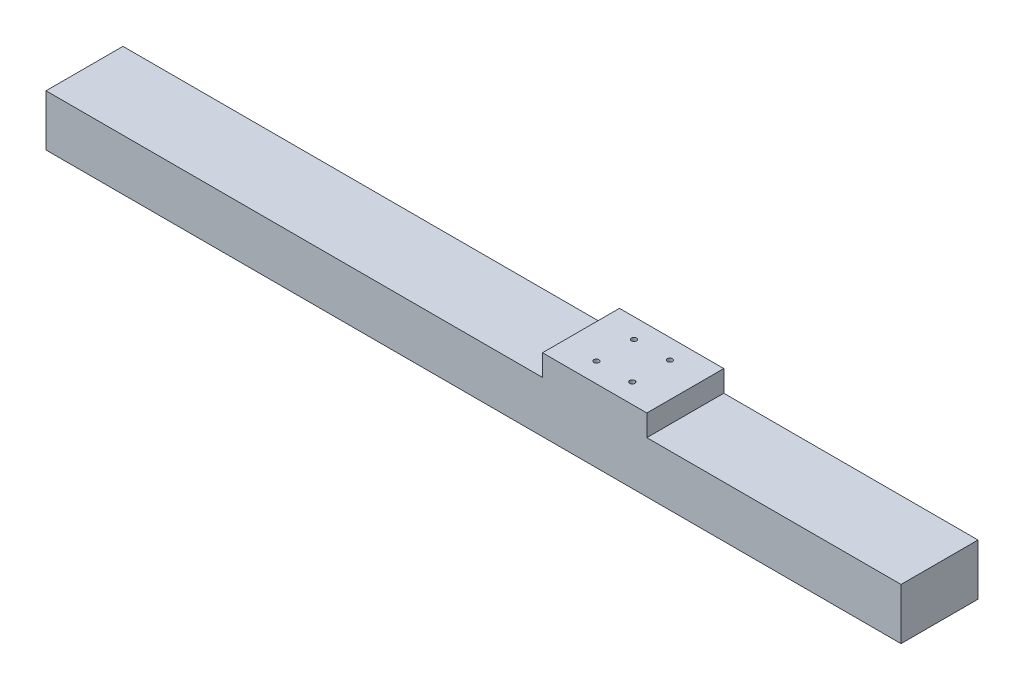
ISO-10303-21;
HEADER;
FILE_DESCRIPTION(('STEP AP214'),'2;1');
FILE_NAME('part.step','',(''),(''),'','','');
FILE_SCHEMA(('AUTOMOTIVE_DESIGN { 1 0 10303 214 1 1 1 1 }'));
ENDSEC;
DATA;
#1=APPLICATION_CONTEXT('core data for automotive mechanical design processes');
#2=APPLICATION_PROTOCOL_DEFINITION('international standard','automotive_design',2000,#1);
#3=PRODUCT_CONTEXT('',#1,'mechanical');
#4=PRODUCT('Part','Part','',(#3));
#5=PRODUCT_RELATED_PRODUCT_CATEGORY('part','',(#4));
#6=PRODUCT_DEFINITION_FORMATION('','',#4);
#7=PRODUCT_DEFINITION_CONTEXT('part definition',#1,'design');
#8=PRODUCT_DEFINITION('design','',#6,#7);
#9=PRODUCT_DEFINITION_SHAPE('','',#8);
#10=(LENGTH_UNIT() NAMED_UNIT(*) SI_UNIT(.MILLI.,.METRE.));
#11=(NAMED_UNIT(*) PLANE_ANGLE_UNIT() SI_UNIT($,.RADIAN.));
#12=(NAMED_UNIT(*) SI_UNIT($,.STERADIAN.) SOLID_ANGLE_UNIT());
#13=UNCERTAINTY_MEASURE_WITH_UNIT(LENGTH_MEASURE(1.E-05),#10,'distance_accuracy_value','');
#14=(GEOMETRIC_REPRESENTATION_CONTEXT(3) GLOBAL_UNCERTAINTY_ASSIGNED_CONTEXT((#13)) GLOBAL_UNIT_ASSIGNED_CONTEXT((#10,
#11,#12)) REPRESENTATION_CONTEXT('',''));
#15=CARTESIAN_POINT('',(0.,0.,0.));
#16=DIRECTION('',(0.,0.,1.));
#17=DIRECTION('',(1.,0.,0.));
#18=AXIS2_PLACEMENT_3D('',#15,#16,#17);
#19=CARTESIAN_POINT('',(0.,60.,0.));
#20=DIRECTION('',(0.,1.,0.));
#21=DIRECTION('',(0.,0.,1.));
#22=AXIS2_PLACEMENT_3D('',#19,#20,#21);
#23=PLANE('',#22);
#24=DIRECTION('',(0.,0.,1.));
#25=VECTOR('',#24,1.);
#26=CARTESIAN_POINT('',(455.382198594935,60.,0.));
#27=LINE('',#26,#25);
#28=CARTESIAN_POINT('',(455.382198594935,60.,0.));
#29=VERTEX_POINT('',#28);
#30=CARTESIAN_POINT('',(455.382198594935,60.,90.));
#31=VERTEX_POINT('',#30);
#32=EDGE_CURVE('E52',#29,#31,#27,.T.);
#33=ORIENTED_EDGE('',*,*,#32,.F.);
#34=DIRECTION('',(-1.,0.,0.));
#35=VECTOR('',#34,1.);
#36=CARTESIAN_POINT('',(-125.305466237942,60.,0.));
#37=LINE('',#36,#35);
#38=CARTESIAN_POINT('',(-125.305466237942,60.,0.));
#39=VERTEX_POINT('',#38);
#40=EDGE_CURVE('E141',#29,#39,#37,.T.);
#41=ORIENTED_EDGE('',*,*,#40,.T.);
#42=DIRECTION('',(0.,0.,1.));
#43=VECTOR('',#42,1.);
#44=CARTESIAN_POINT('',(-125.305466237942,60.,0.));
#45=LINE('',#44,#43);
#46=CARTESIAN_POINT('',(-125.305466237942,60.,90.));
#47=VERTEX_POINT('',#46);
#48=EDGE_CURVE('E132',#39,#47,#45,.T.);
#49=ORIENTED_EDGE('',*,*,#48,.T.);
#50=DIRECTION('',(1.,0.,0.));
#51=VECTOR('',#50,1.);
#52=CARTESIAN_POINT('',(-125.305466237942,60.,90.));
#53=LINE('',#52,#51);
#54=EDGE_CURVE('E137',#47,#31,#53,.T.);
#55=ORIENTED_EDGE('',*,*,#54,.T.);
#56=EDGE_LOOP('',(#33,#41,#49,#55));
#57=FACE_BOUND('',#56,.T.);
#58=ADVANCED_FACE('F37',(#57),#23,.T.);
#59=CARTESIAN_POINT('',(-125.305466237942,60.,0.));
#60=DIRECTION('',(1.,0.,0.));
#61=DIRECTION('',(0.,0.,-1.));
#62=AXIS2_PLACEMENT_3D('',#59,#60,#61);
#63=PLANE('',#62);
#64=DIRECTION('',(0.,0.,1.));
#65=VECTOR('',#64,1.);
#66=CARTESIAN_POINT('',(-125.305466237942,0.,0.));
#67=LINE('',#66,#65);
#68=CARTESIAN_POINT('',(-125.305466237942,0.,0.));
#69=VERTEX_POINT('',#68);
#70=CARTESIAN_POINT('',(-125.305466237942,0.,90.));
#71=VERTEX_POINT('',#70);
#72=EDGE_CURVE('E123',#69,#71,#67,.T.);
#73=ORIENTED_EDGE('',*,*,#72,.T.);
#74=DIRECTION('',(0.,-1.,0.));
#75=VECTOR('',#74,1.);
#76=CARTESIAN_POINT('',(-125.305466237942,60.,90.));
#77=LINE('',#76,#75);
#78=EDGE_CURVE('E11',#47,#71,#77,.T.);
#79=ORIENTED_EDGE('',*,*,#78,.F.);
#80=ORIENTED_EDGE('',*,*,#48,.F.);
#81=DIRECTION('',(0.,-1.,0.));
#82=VECTOR('',#81,1.);
#83=CARTESIAN_POINT('',(-125.305466237942,60.,0.));
#84=LINE('',#83,#82);
#85=EDGE_CURVE('E143',#39,#69,#84,.T.);
#86=ORIENTED_EDGE('',*,*,#85,.T.);
#87=EDGE_LOOP('',(#73,#79,#80,#86));
#88=FACE_BOUND('',#87,.T.);
#89=ADVANCED_FACE('F39',(#88),#63,.F.);
#90=CARTESIAN_POINT('',(-125.305466237942,60.,90.));
#91=DIRECTION('',(0.,0.,-1.));
#92=DIRECTION('',(-1.,0.,0.));
#93=AXIS2_PLACEMENT_3D('',#90,#91,#92);
#94=PLANE('',#93);
#95=DIRECTION('',(1.,0.,0.));
#96=VECTOR('',#95,1.);
#97=CARTESIAN_POINT('',(-125.305466237942,0.,90.));
#98=LINE('',#97,#96);
#99=CARTESIAN_POINT('',(874.694533762058,0.,90.));
#100=VERTEX_POINT('',#99);
#101=EDGE_CURVE('E126',#71,#100,#98,.T.);
#102=ORIENTED_EDGE('',*,*,#101,.T.);
#103=DIRECTION('',(0.,-1.,0.));
#104=VECTOR('',#103,1.);
#105=CARTESIAN_POINT('',(874.694533762058,60.,90.));
#106=LINE('',#105,#104);
#107=CARTESIAN_POINT('',(874.694533762058,60.,90.));
#108=VERTEX_POINT('',#107);
#109=EDGE_CURVE('E45',#108,#100,#106,.T.);
#110=ORIENTED_EDGE('',*,*,#109,.F.);
#111=CARTESIAN_POINT('',(577.382198594935,60.,90.));
#112=VERTEX_POINT('',#111);
#113=EDGE_CURVE('E135',#112,#108,#53,.T.);
#114=ORIENTED_EDGE('',*,*,#113,.F.);
#115=DIRECTION('',(0.,-1.,0.));
#116=VECTOR('',#115,1.);
#117=CARTESIAN_POINT('',(577.382198594935,85.,90.));
#118=LINE('',#117,#116);
#119=CARTESIAN_POINT('',(577.382198594935,85.,90.));
#120=VERTEX_POINT('',#119);
#121=EDGE_CURVE('E108',#120,#112,#118,.T.);
#122=ORIENTED_EDGE('',*,*,#121,.F.);
#123=DIRECTION('',(1.,0.,0.));
#124=VECTOR('',#123,1.);
#125=CARTESIAN_POINT('',(455.382198594935,85.,90.));
#126=LINE('',#125,#124);
#127=CARTESIAN_POINT('',(455.382198594935,85.,90.));
#128=VERTEX_POINT('',#127);
#129=EDGE_CURVE('E102',#128,#120,#126,.T.);
#130=ORIENTED_EDGE('',*,*,#129,.F.);
#131=DIRECTION('',(0.,-1.,0.));
#132=VECTOR('',#131,1.);
#133=CARTESIAN_POINT('',(455.382198594935,85.,90.));
#134=LINE('',#133,#132);
#135=EDGE_CURVE('E106',#128,#31,#134,.T.);
#136=ORIENTED_EDGE('',*,*,#135,.T.);
#137=ORIENTED_EDGE('',*,*,#54,.F.);
#138=ORIENTED_EDGE('',*,*,#78,.T.);
#139=EDGE_LOOP('',(#102,#110,#114,#122,#130,#136,#137,#138));
#140=FACE_BOUND('',#139,.T.);
#141=ADVANCED_FACE('F104',(#140),#94,.F.);
#142=CARTESIAN_POINT('',(874.694533762058,60.,0.));
#143=DIRECTION('',(-1.,0.,0.));
#144=DIRECTION('',(0.,0.,1.));
#145=AXIS2_PLACEMENT_3D('',#142,#143,#144);
#146=PLANE('',#145);
#147=DIRECTION('',(0.,0.,-1.));
#148=VECTOR('',#147,1.);
#149=CARTESIAN_POINT('',(874.694533762058,0.,0.));
#150=LINE('',#149,#148);
#151=CARTESIAN_POINT('',(874.694533762058,0.,0.));
#152=VERTEX_POINT('',#151);
#153=EDGE_CURVE('E146',#100,#152,#150,.T.);
#154=ORIENTED_EDGE('',*,*,#153,.T.);
#155=DIRECTION('',(0.,-1.,0.));
#156=VECTOR('',#155,1.);
#157=CARTESIAN_POINT('',(874.694533762058,60.,0.));
#158=LINE('',#157,#156);
#159=CARTESIAN_POINT('',(874.694533762058,60.,0.));
#160=VERTEX_POINT('',#159);
#161=EDGE_CURVE('E151',#160,#152,#158,.T.);
#162=ORIENTED_EDGE('',*,*,#161,.F.);
#163=DIRECTION('',(0.,0.,-1.));
#164=VECTOR('',#163,1.);
#165=CARTESIAN_POINT('',(874.694533762058,60.,0.));
#166=LINE('',#165,#164);
#167=EDGE_CURVE('E139',#108,#160,#166,.T.);
#168=ORIENTED_EDGE('',*,*,#167,.F.);
#169=ORIENTED_EDGE('',*,*,#109,.T.);
#170=EDGE_LOOP('',(#154,#162,#168,#169));
#171=FACE_BOUND('',#170,.T.);
#172=ADVANCED_FACE('F158',(#171),#146,.F.);
#173=CARTESIAN_POINT('',(-125.305466237942,60.,0.));
#174=DIRECTION('',(0.,0.,1.));
#175=DIRECTION('',(1.,0.,0.));
#176=AXIS2_PLACEMENT_3D('',#173,#174,#175);
#177=PLANE('',#176);
#178=DIRECTION('',(-1.,0.,0.));
#179=VECTOR('',#178,1.);
#180=CARTESIAN_POINT('',(-125.305466237942,0.,0.));
#181=LINE('',#180,#179);
#182=EDGE_CURVE('E136',#152,#69,#181,.T.);
#183=ORIENTED_EDGE('',*,*,#182,.T.);
#184=ORIENTED_EDGE('',*,*,#85,.F.);
#185=ORIENTED_EDGE('',*,*,#40,.F.);
#186=DIRECTION('',(0.,-1.,0.));
#187=VECTOR('',#186,1.);
#188=CARTESIAN_POINT('',(455.382198594935,85.,0.));
#189=LINE('',#188,#187);
#190=CARTESIAN_POINT('',(455.382198594935,85.,0.));
#191=VERTEX_POINT('',#190);
#192=EDGE_CURVE('E171',#191,#29,#189,.T.);
#193=ORIENTED_EDGE('',*,*,#192,.F.);
#194=DIRECTION('',(-1.,0.,0.));
#195=VECTOR('',#194,1.);
#196=CARTESIAN_POINT('',(455.382198594935,85.,0.));
#197=LINE('',#196,#195);
#198=CARTESIAN_POINT('',(577.382198594935,85.,0.));
#199=VERTEX_POINT('',#198);
#200=EDGE_CURVE('E117',#199,#191,#197,.T.);
#201=ORIENTED_EDGE('',*,*,#200,.F.);
#202=DIRECTION('',(0.,-1.,0.));
#203=VECTOR('',#202,1.);
#204=CARTESIAN_POINT('',(577.382198594935,85.,0.));
#205=LINE('',#204,#203);
#206=CARTESIAN_POINT('',(577.382198594935,60.,0.));
#207=VERTEX_POINT('',#206);
#208=EDGE_CURVE('E128',#199,#207,#205,.T.);
#209=ORIENTED_EDGE('',*,*,#208,.T.);
#210=EDGE_CURVE('E142',#160,#207,#37,.T.);
#211=ORIENTED_EDGE('',*,*,#210,.F.);
#212=ORIENTED_EDGE('',*,*,#161,.T.);
#213=EDGE_LOOP('',(#183,#184,#185,#193,#201,#209,#211,#212));
#214=FACE_BOUND('',#213,.T.);
#215=ADVANCED_FACE('F166',(#214),#177,.F.);
#216=DIRECTION('',(0.,0.,-1.));
#217=VECTOR('',#216,1.);
#218=CARTESIAN_POINT('',(577.382198594935,60.,0.));
#219=LINE('',#218,#217);
#220=EDGE_CURVE('E60',#112,#207,#219,.T.);
#221=ORIENTED_EDGE('',*,*,#220,.F.);
#222=ORIENTED_EDGE('',*,*,#113,.T.);
#223=ORIENTED_EDGE('',*,*,#167,.T.);
#224=ORIENTED_EDGE('',*,*,#210,.T.);
#225=EDGE_LOOP('',(#221,#222,#223,#224));
#226=FACE_BOUND('',#225,.T.);
#227=ADVANCED_FACE('F226',(#226),#23,.T.);
#228=CARTESIAN_POINT('',(0.,0.,0.));
#229=DIRECTION('',(0.,1.,0.));
#230=DIRECTION('',(0.,0.,1.));
#231=AXIS2_PLACEMENT_3D('',#228,#229,#230);
#232=PLANE('',#231);
#233=ORIENTED_EDGE('',*,*,#72,.F.);
#234=ORIENTED_EDGE('',*,*,#182,.F.);
#235=ORIENTED_EDGE('',*,*,#153,.F.);
#236=ORIENTED_EDGE('',*,*,#101,.F.);
#237=EDGE_LOOP('',(#233,#234,#235,#236));
#238=FACE_BOUND('',#237,.T.);
#239=ADVANCED_FACE('F163',(#238),#232,.F.);
#240=CARTESIAN_POINT('',(455.382198594935,85.,0.));
#241=DIRECTION('',(1.,0.,0.));
#242=DIRECTION('',(0.,0.,-1.));
#243=AXIS2_PLACEMENT_3D('',#240,#241,#242);
#244=PLANE('',#243);
#245=ORIENTED_EDGE('',*,*,#32,.T.);
#246=ORIENTED_EDGE('',*,*,#135,.F.);
#247=DIRECTION('',(0.,0.,1.));
#248=VECTOR('',#247,1.);
#249=CARTESIAN_POINT('',(455.382198594935,85.,0.));
#250=LINE('',#249,#248);
#251=EDGE_CURVE('E112',#191,#128,#250,.T.);
#252=ORIENTED_EDGE('',*,*,#251,.F.);
#253=ORIENTED_EDGE('',*,*,#192,.T.);
#254=EDGE_LOOP('',(#245,#246,#252,#253));
#255=FACE_BOUND('',#254,.T.);
#256=ADVANCED_FACE('F122',(#255),#244,.F.);
#257=CARTESIAN_POINT('',(577.382198594935,85.,0.));
#258=DIRECTION('',(-1.,0.,0.));
#259=DIRECTION('',(0.,0.,1.));
#260=AXIS2_PLACEMENT_3D('',#257,#258,#259);
#261=PLANE('',#260);
#262=ORIENTED_EDGE('',*,*,#220,.T.);
#263=ORIENTED_EDGE('',*,*,#208,.F.);
#264=DIRECTION('',(0.,0.,-1.));
#265=VECTOR('',#264,1.);
#266=CARTESIAN_POINT('',(577.382198594935,85.,0.));
#267=LINE('',#266,#265);
#268=EDGE_CURVE('E111',#120,#199,#267,.T.);
#269=ORIENTED_EDGE('',*,*,#268,.F.);
#270=ORIENTED_EDGE('',*,*,#121,.T.);
#271=EDGE_LOOP('',(#262,#263,#269,#270));
#272=FACE_BOUND('',#271,.T.);
#273=ADVANCED_FACE('F209',(#272),#261,.F.);
#274=CARTESIAN_POINT('',(0.,85.,0.));
#275=DIRECTION('',(0.,1.,0.));
#276=DIRECTION('',(0.,0.,1.));
#277=AXIS2_PLACEMENT_3D('',#274,#275,#276);
#278=PLANE('',#277);
#279=CARTESIAN_POINT('',(495.382198594935,85.,67.));
#280=DIRECTION('',(0.,1.,0.));
#281=DIRECTION('',(0.,0.,1.));
#282=AXIS2_PLACEMENT_3D('',#279,#280,#281);
#283=CIRCLE('',#282,2.99999999999999);
#284=CARTESIAN_POINT('',(495.382198594935,85.,70.));
#285=VERTEX_POINT('',#284);
#286=EDGE_CURVE('E189',#285,#285,#283,.T.);
#287=ORIENTED_EDGE('',*,*,#286,.F.);
#288=EDGE_LOOP('',(#287));
#289=FACE_BOUND('',#288,.T.);
#290=CARTESIAN_POINT('',(537.382198594936,85.,67.));
#291=DIRECTION('',(0.,1.,0.));
#292=DIRECTION('',(0.,0.,1.));
#293=AXIS2_PLACEMENT_3D('',#290,#291,#292);
#294=CIRCLE('',#293,3.00000000000005);
#295=CARTESIAN_POINT('',(537.382198594936,85.,70.));
#296=VERTEX_POINT('',#295);
#297=EDGE_CURVE('E195',#296,#296,#294,.T.);
#298=ORIENTED_EDGE('',*,*,#297,.F.);
#299=EDGE_LOOP('',(#298));
#300=FACE_BOUND('',#299,.T.);
#301=CARTESIAN_POINT('',(537.382198594936,85.,23.));
#302=DIRECTION('',(0.,1.,0.));
#303=DIRECTION('',(0.,0.,1.));
#304=AXIS2_PLACEMENT_3D('',#301,#302,#303);
#305=CIRCLE('',#304,3.00000000000005);
#306=CARTESIAN_POINT('',(537.382198594936,85.,26.));
#307=VERTEX_POINT('',#306);
#308=EDGE_CURVE('E183',#307,#307,#305,.T.);
#309=ORIENTED_EDGE('',*,*,#308,.F.);
#310=EDGE_LOOP('',(#309));
#311=FACE_BOUND('',#310,.T.);
#312=CARTESIAN_POINT('',(495.382198594935,85.,23.));
#313=DIRECTION('',(0.,1.,0.));
#314=DIRECTION('',(0.,0.,1.));
#315=AXIS2_PLACEMENT_3D('',#312,#313,#314);
#316=CIRCLE('',#315,2.99999999999999);
#317=CARTESIAN_POINT('',(495.382198594935,85.,26.));
#318=VERTEX_POINT('',#317);
#319=EDGE_CURVE('E180',#318,#318,#316,.T.);
#320=ORIENTED_EDGE('',*,*,#319,.F.);
#321=EDGE_LOOP('',(#320));
#322=FACE_BOUND('',#321,.T.);
#323=ORIENTED_EDGE('',*,*,#251,.T.);
#324=ORIENTED_EDGE('',*,*,#129,.T.);
#325=ORIENTED_EDGE('',*,*,#268,.T.);
#326=ORIENTED_EDGE('',*,*,#200,.T.);
#327=EDGE_LOOP('',(#323,#324,#325,#326));
#328=FACE_BOUND('',#327,.T.);
#329=ADVANCED_FACE('F115',(#289,#300,#311,#322,#328),#278,.T.);
#330=CARTESIAN_POINT('',(495.382198594935,75.,23.));
#331=DIRECTION('',(0.,1.,0.));
#332=DIRECTION('',(0.,0.,1.));
#333=AXIS2_PLACEMENT_3D('',#330,#331,#332);
#334=CYLINDRICAL_SURFACE('',#333,2.99999999999999);
#335=CARTESIAN_POINT('',(495.382198594935,75.,23.));
#336=DIRECTION('',(0.,1.,0.));
#337=DIRECTION('',(0.,0.,1.));
#338=AXIS2_PLACEMENT_3D('',#335,#336,#337);
#339=CIRCLE('',#338,2.99999999999999);
#340=CARTESIAN_POINT('',(495.382198594935,75.,26.));
#341=VERTEX_POINT('',#340);
#342=EDGE_CURVE('E177',#341,#341,#339,.T.);
#343=ORIENTED_EDGE('',*,*,#342,.F.);
#344=EDGE_LOOP('',(#343));
#345=FACE_BOUND('',#344,.T.);
#346=ORIENTED_EDGE('',*,*,#319,.T.);
#347=EDGE_LOOP('',(#346));
#348=FACE_BOUND('',#347,.T.);
#349=ADVANCED_FACE('F208',(#345,#348),#334,.F.);
#350=CARTESIAN_POINT('',(495.382198594935,75.,23.));
#351=DIRECTION('',(0.,1.,0.));
#352=DIRECTION('',(0.,0.,1.));
#353=AXIS2_PLACEMENT_3D('',#350,#351,#352);
#354=PLANE('',#353);
#355=ORIENTED_EDGE('',*,*,#342,.T.);
#356=EDGE_LOOP('',(#355));
#357=FACE_BOUND('',#356,.T.);
#358=ADVANCED_FACE('F215',(#357),#354,.T.);
#359=CARTESIAN_POINT('',(537.382198594936,75.,23.));
#360=DIRECTION('',(0.,1.,0.));
#361=DIRECTION('',(0.,0.,1.));
#362=AXIS2_PLACEMENT_3D('',#359,#360,#361);
#363=CYLINDRICAL_SURFACE('',#362,3.00000000000005);
#364=CARTESIAN_POINT('',(537.382198594936,75.,23.));
#365=DIRECTION('',(0.,1.,0.));
#366=DIRECTION('',(0.,0.,1.));
#367=AXIS2_PLACEMENT_3D('',#364,#365,#366);
#368=CIRCLE('',#367,3.00000000000005);
#369=CARTESIAN_POINT('',(537.382198594936,75.,26.));
#370=VERTEX_POINT('',#369);
#371=EDGE_CURVE('E198',#370,#370,#368,.T.);
#372=ORIENTED_EDGE('',*,*,#371,.F.);
#373=EDGE_LOOP('',(#372));
#374=FACE_BOUND('',#373,.T.);
#375=ORIENTED_EDGE('',*,*,#308,.T.);
#376=EDGE_LOOP('',(#375));
#377=FACE_BOUND('',#376,.T.);
#378=ADVANCED_FACE('F204',(#374,#377),#363,.F.);
#379=CARTESIAN_POINT('',(537.382198594936,75.,23.));
#380=DIRECTION('',(0.,1.,0.));
#381=DIRECTION('',(0.,0.,1.));
#382=AXIS2_PLACEMENT_3D('',#379,#380,#381);
#383=PLANE('',#382);
#384=ORIENTED_EDGE('',*,*,#371,.T.);
#385=EDGE_LOOP('',(#384));
#386=FACE_BOUND('',#385,.T.);
#387=ADVANCED_FACE('F315',(#386),#383,.T.);
#388=CARTESIAN_POINT('',(537.382198594936,75.,67.));
#389=DIRECTION('',(0.,1.,0.));
#390=DIRECTION('',(0.,0.,1.));
#391=AXIS2_PLACEMENT_3D('',#388,#389,#390);
#392=CYLINDRICAL_SURFACE('',#391,3.00000000000005);
#393=CARTESIAN_POINT('',(537.382198594936,75.,67.));
#394=DIRECTION('',(0.,1.,0.));
#395=DIRECTION('',(0.,0.,1.));
#396=AXIS2_PLACEMENT_3D('',#393,#394,#395);
#397=CIRCLE('',#396,3.00000000000005);
#398=CARTESIAN_POINT('',(537.382198594936,75.,70.));
#399=VERTEX_POINT('',#398);
#400=EDGE_CURVE('E192',#399,#399,#397,.T.);
#401=ORIENTED_EDGE('',*,*,#400,.F.);
#402=EDGE_LOOP('',(#401));
#403=FACE_BOUND('',#402,.T.);
#404=ORIENTED_EDGE('',*,*,#297,.T.);
#405=EDGE_LOOP('',(#404));
#406=FACE_BOUND('',#405,.T.);
#407=ADVANCED_FACE('F325',(#403,#406),#392,.F.);
#408=CARTESIAN_POINT('',(537.382198594936,75.,67.));
#409=DIRECTION('',(0.,1.,0.));
#410=DIRECTION('',(0.,0.,1.));
#411=AXIS2_PLACEMENT_3D('',#408,#409,#410);
#412=PLANE('',#411);
#413=ORIENTED_EDGE('',*,*,#400,.T.);
#414=EDGE_LOOP('',(#413));
#415=FACE_BOUND('',#414,.T.);
#416=ADVANCED_FACE('F335',(#415),#412,.T.);
#417=CARTESIAN_POINT('',(495.382198594935,75.,67.));
#418=DIRECTION('',(0.,1.,0.));
#419=DIRECTION('',(0.,0.,1.));
#420=AXIS2_PLACEMENT_3D('',#417,#418,#419);
#421=CYLINDRICAL_SURFACE('',#420,2.99999999999999);
#422=CARTESIAN_POINT('',(495.382198594935,75.,67.));
#423=DIRECTION('',(0.,1.,0.));
#424=DIRECTION('',(0.,0.,1.));
#425=AXIS2_PLACEMENT_3D('',#422,#423,#424);
#426=CIRCLE('',#425,2.99999999999999);
#427=CARTESIAN_POINT('',(495.382198594935,75.,70.));
#428=VERTEX_POINT('',#427);
#429=EDGE_CURVE('E186',#428,#428,#426,.T.);
#430=ORIENTED_EDGE('',*,*,#429,.F.);
#431=EDGE_LOOP('',(#430));
#432=FACE_BOUND('',#431,.T.);
#433=ORIENTED_EDGE('',*,*,#286,.T.);
#434=EDGE_LOOP('',(#433));
#435=FACE_BOUND('',#434,.T.);
#436=ADVANCED_FACE('F345',(#432,#435),#421,.F.);
#437=CARTESIAN_POINT('',(495.382198594935,75.,67.));
#438=DIRECTION('',(0.,1.,0.));
#439=DIRECTION('',(0.,0.,1.));
#440=AXIS2_PLACEMENT_3D('',#437,#438,#439);
#441=PLANE('',#440);
#442=ORIENTED_EDGE('',*,*,#429,.T.);
#443=EDGE_LOOP('',(#442));
#444=FACE_BOUND('',#443,.T.);
#445=ADVANCED_FACE('F355',(#444),#441,.T.);
#446=CLOSED_SHELL('',(#58,#89,#141,#172,#215,#227,#239,#256,#273,#329,#349,#358,#378,#387,#407,
#416,#436,#445));
#447=MANIFOLD_SOLID_BREP('B2',#446);
#448=ADVANCED_BREP_SHAPE_REPRESENTATION('',(#18,#447),#14);
#449=SHAPE_DEFINITION_REPRESENTATION(#9,#448);
ENDSEC;
END-ISO-10303-21;
